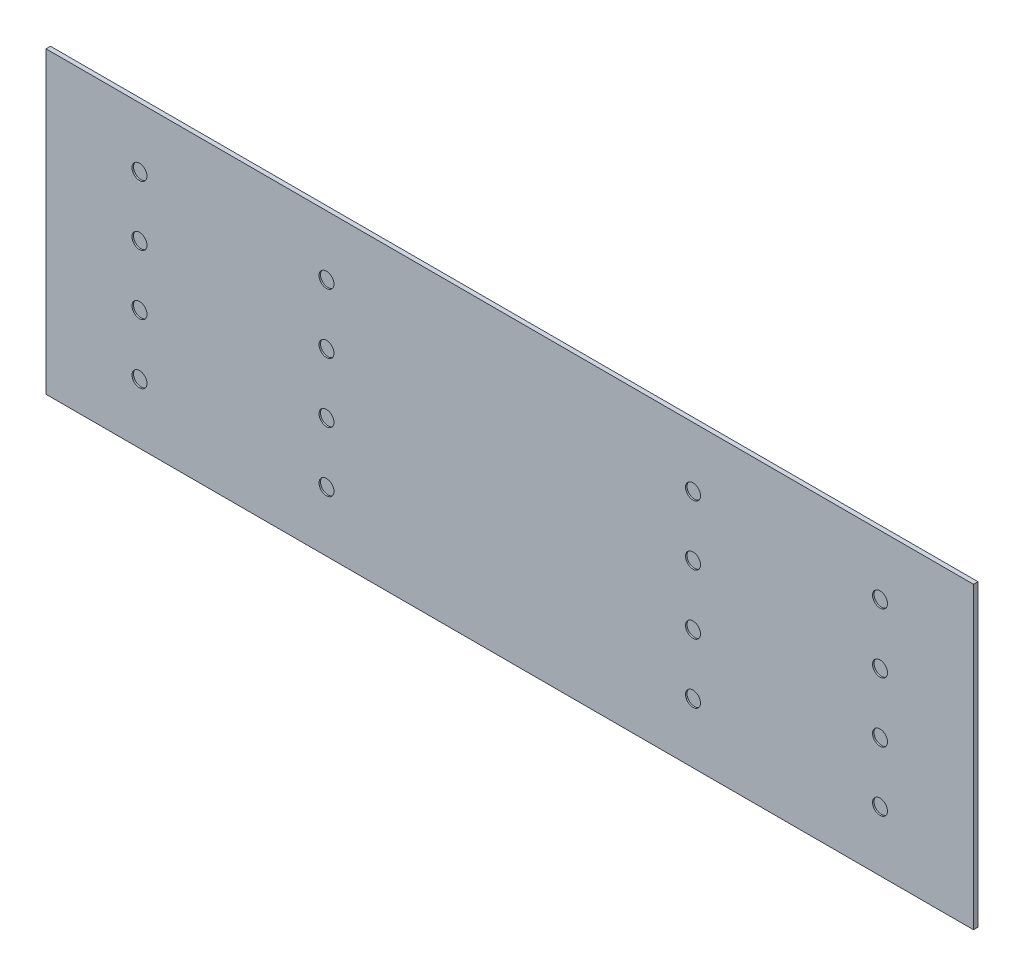
ISO-10303-21;
HEADER;
FILE_DESCRIPTION(('STEP AP214'),'2;1');
FILE_NAME('part.step','',(''),(''),'','','');
FILE_SCHEMA(('AUTOMOTIVE_DESIGN { 1 0 10303 214 1 1 1 1 }'));
ENDSEC;
DATA;
#1=APPLICATION_CONTEXT('core data for automotive mechanical design processes');
#2=APPLICATION_PROTOCOL_DEFINITION('international standard','automotive_design',2000,#1);
#3=PRODUCT_CONTEXT('',#1,'mechanical');
#4=PRODUCT('Part','Part','',(#3));
#5=PRODUCT_RELATED_PRODUCT_CATEGORY('part','',(#4));
#6=PRODUCT_DEFINITION_FORMATION('','',#4);
#7=PRODUCT_DEFINITION_CONTEXT('part definition',#1,'design');
#8=PRODUCT_DEFINITION('design','',#6,#7);
#9=PRODUCT_DEFINITION_SHAPE('','',#8);
#10=(LENGTH_UNIT() NAMED_UNIT(*) SI_UNIT(.MILLI.,.METRE.));
#11=(NAMED_UNIT(*) PLANE_ANGLE_UNIT() SI_UNIT($,.RADIAN.));
#12=(NAMED_UNIT(*) SI_UNIT($,.STERADIAN.) SOLID_ANGLE_UNIT());
#13=UNCERTAINTY_MEASURE_WITH_UNIT(LENGTH_MEASURE(1.E-05),#10,'distance_accuracy_value','');
#14=(GEOMETRIC_REPRESENTATION_CONTEXT(3) GLOBAL_UNCERTAINTY_ASSIGNED_CONTEXT((#13)) GLOBAL_UNIT_ASSIGNED_CONTEXT((#10,
#11,#12)) REPRESENTATION_CONTEXT('',''));
#15=CARTESIAN_POINT('',(0.,0.,0.));
#16=DIRECTION('',(0.,0.,1.));
#17=DIRECTION('',(1.,0.,0.));
#18=AXIS2_PLACEMENT_3D('',#15,#16,#17);
#19=CARTESIAN_POINT('',(31.,10.,0.3));
#20=DIRECTION('',(-1.,0.,0.));
#21=DIRECTION('',(0.,-1.,0.));
#22=AXIS2_PLACEMENT_3D('',#19,#20,#21);
#23=PLANE('',#22);
#24=DIRECTION('',(0.,1.,0.));
#25=VECTOR('',#24,1.);
#26=CARTESIAN_POINT('',(31.,10.,0.));
#27=LINE('',#26,#25);
#28=CARTESIAN_POINT('',(31.,-10.,0.));
#29=VERTEX_POINT('',#28);
#30=CARTESIAN_POINT('',(31.,10.,0.));
#31=VERTEX_POINT('',#30);
#32=EDGE_CURVE('E96',#29,#31,#27,.T.);
#33=ORIENTED_EDGE('',*,*,#32,.T.);
#34=DIRECTION('',(0.,0.,-1.));
#35=VECTOR('',#34,1.);
#36=CARTESIAN_POINT('',(31.,10.,0.3));
#37=LINE('',#36,#35);
#38=CARTESIAN_POINT('',(31.,10.,0.3));
#39=VERTEX_POINT('',#38);
#40=EDGE_CURVE('E11',#39,#31,#37,.T.);
#41=ORIENTED_EDGE('',*,*,#40,.F.);
#42=DIRECTION('',(0.,1.,0.));
#43=VECTOR('',#42,1.);
#44=CARTESIAN_POINT('',(31.,10.,0.3));
#45=LINE('',#44,#43);
#46=CARTESIAN_POINT('',(31.,-10.,0.3));
#47=VERTEX_POINT('',#46);
#48=EDGE_CURVE('E84',#47,#39,#45,.T.);
#49=ORIENTED_EDGE('',*,*,#48,.F.);
#50=DIRECTION('',(0.,0.,-1.));
#51=VECTOR('',#50,1.);
#52=CARTESIAN_POINT('',(31.,-10.,0.3));
#53=LINE('',#52,#51);
#54=EDGE_CURVE('E92',#47,#29,#53,.T.);
#55=ORIENTED_EDGE('',*,*,#54,.T.);
#56=EDGE_LOOP('',(#33,#41,#49,#55));
#57=FACE_BOUND('',#56,.T.);
#58=ADVANCED_FACE('F33',(#57),#23,.F.);
#59=CARTESIAN_POINT('',(-31.,10.,0.3));
#60=DIRECTION('',(0.,-1.,0.));
#61=DIRECTION('',(0.,0.,-1.));
#62=AXIS2_PLACEMENT_3D('',#59,#60,#61);
#63=PLANE('',#62);
#64=DIRECTION('',(-1.,0.,0.));
#65=VECTOR('',#64,1.);
#66=CARTESIAN_POINT('',(-31.,10.,0.));
#67=LINE('',#66,#65);
#68=CARTESIAN_POINT('',(-31.,10.,0.));
#69=VERTEX_POINT('',#68);
#70=EDGE_CURVE('E88',#31,#69,#67,.T.);
#71=ORIENTED_EDGE('',*,*,#70,.T.);
#72=DIRECTION('',(0.,0.,-1.));
#73=VECTOR('',#72,1.);
#74=CARTESIAN_POINT('',(-31.,10.,0.3));
#75=LINE('',#74,#73);
#76=CARTESIAN_POINT('',(-31.,10.,0.3));
#77=VERTEX_POINT('',#76);
#78=EDGE_CURVE('E41',#77,#69,#75,.T.);
#79=ORIENTED_EDGE('',*,*,#78,.F.);
#80=DIRECTION('',(-1.,0.,0.));
#81=VECTOR('',#80,1.);
#82=CARTESIAN_POINT('',(-31.,10.,0.3));
#83=LINE('',#82,#81);
#84=EDGE_CURVE('E79',#39,#77,#83,.T.);
#85=ORIENTED_EDGE('',*,*,#84,.F.);
#86=ORIENTED_EDGE('',*,*,#40,.T.);
#87=EDGE_LOOP('',(#71,#79,#85,#86));
#88=FACE_BOUND('',#87,.T.);
#89=ADVANCED_FACE('F87',(#88),#63,.F.);
#90=CARTESIAN_POINT('',(-31.,10.,0.3));
#91=DIRECTION('',(1.,0.,0.));
#92=DIRECTION('',(0.,1.,0.));
#93=AXIS2_PLACEMENT_3D('',#90,#91,#92);
#94=PLANE('',#93);
#95=DIRECTION('',(0.,-1.,0.));
#96=VECTOR('',#95,1.);
#97=CARTESIAN_POINT('',(-31.,10.,0.));
#98=LINE('',#97,#96);
#99=CARTESIAN_POINT('',(-31.,-10.,0.));
#100=VERTEX_POINT('',#99);
#101=EDGE_CURVE('E66',#69,#100,#98,.T.);
#102=ORIENTED_EDGE('',*,*,#101,.T.);
#103=DIRECTION('',(0.,0.,-1.));
#104=VECTOR('',#103,1.);
#105=CARTESIAN_POINT('',(-31.,-10.,0.3));
#106=LINE('',#105,#104);
#107=CARTESIAN_POINT('',(-31.,-10.,0.3));
#108=VERTEX_POINT('',#107);
#109=EDGE_CURVE('E89',#108,#100,#106,.T.);
#110=ORIENTED_EDGE('',*,*,#109,.F.);
#111=DIRECTION('',(0.,-1.,0.));
#112=VECTOR('',#111,1.);
#113=CARTESIAN_POINT('',(-31.,10.,0.3));
#114=LINE('',#113,#112);
#115=EDGE_CURVE('E82',#77,#108,#114,.T.);
#116=ORIENTED_EDGE('',*,*,#115,.F.);
#117=ORIENTED_EDGE('',*,*,#78,.T.);
#118=EDGE_LOOP('',(#102,#110,#116,#117));
#119=FACE_BOUND('',#118,.T.);
#120=ADVANCED_FACE('F90',(#119),#94,.F.);
#121=CARTESIAN_POINT('',(-31.,-10.,0.3));
#122=DIRECTION('',(0.,1.,0.));
#123=DIRECTION('',(0.,0.,1.));
#124=AXIS2_PLACEMENT_3D('',#121,#122,#123);
#125=PLANE('',#124);
#126=DIRECTION('',(1.,0.,0.));
#127=VECTOR('',#126,1.);
#128=CARTESIAN_POINT('',(-31.,-10.,0.));
#129=LINE('',#128,#127);
#130=EDGE_CURVE('E72',#100,#29,#129,.T.);
#131=ORIENTED_EDGE('',*,*,#130,.T.);
#132=ORIENTED_EDGE('',*,*,#54,.F.);
#133=DIRECTION('',(1.,0.,0.));
#134=VECTOR('',#133,1.);
#135=CARTESIAN_POINT('',(-31.,-10.,0.3));
#136=LINE('',#135,#134);
#137=EDGE_CURVE('E49',#108,#47,#136,.T.);
#138=ORIENTED_EDGE('',*,*,#137,.F.);
#139=ORIENTED_EDGE('',*,*,#109,.T.);
#140=EDGE_LOOP('',(#131,#132,#138,#139));
#141=FACE_BOUND('',#140,.T.);
#142=ADVANCED_FACE('F104',(#141),#125,.F.);
#143=CARTESIAN_POINT('',(0.,0.,0.3));
#144=DIRECTION('',(0.,0.,1.));
#145=DIRECTION('',(1.,0.,0.));
#146=AXIS2_PLACEMENT_3D('',#143,#144,#145);
#147=PLANE('',#146);
#148=CARTESIAN_POINT('',(-12.25,2.,0.3));
#149=DIRECTION('',(0.,0.,1.));
#150=DIRECTION('',(-1.,0.,0.));
#151=AXIS2_PLACEMENT_3D('',#148,#149,#150);
#152=CIRCLE('',#151,0.499999999999999);
#153=CARTESIAN_POINT('',(-12.75,2.,0.3));
#154=VERTEX_POINT('',#153);
#155=EDGE_CURVE('E140',#154,#154,#152,.T.);
#156=ORIENTED_EDGE('',*,*,#155,.F.);
#157=EDGE_LOOP('',(#156));
#158=FACE_BOUND('',#157,.T.);
#159=CARTESIAN_POINT('',(-24.75,2.,0.3));
#160=DIRECTION('',(0.,0.,1.));
#161=DIRECTION('',(1.,0.,0.));
#162=AXIS2_PLACEMENT_3D('',#159,#160,#161);
#163=CIRCLE('',#162,0.499999999999999);
#164=CARTESIAN_POINT('',(-24.25,2.,0.3));
#165=VERTEX_POINT('',#164);
#166=EDGE_CURVE('E147',#165,#165,#163,.T.);
#167=ORIENTED_EDGE('',*,*,#166,.F.);
#168=EDGE_LOOP('',(#167));
#169=FACE_BOUND('',#168,.T.);
#170=CARTESIAN_POINT('',(-24.75,-2.,0.3));
#171=DIRECTION('',(0.,0.,1.));
#172=DIRECTION('',(-1.,0.,0.));
#173=AXIS2_PLACEMENT_3D('',#170,#171,#172);
#174=CIRCLE('',#173,0.499999999999999);
#175=CARTESIAN_POINT('',(-25.25,-2.,0.3));
#176=VERTEX_POINT('',#175);
#177=EDGE_CURVE('E153',#176,#176,#174,.T.);
#178=ORIENTED_EDGE('',*,*,#177,.F.);
#179=EDGE_LOOP('',(#178));
#180=FACE_BOUND('',#179,.T.);
#181=CARTESIAN_POINT('',(-24.75,-6.,0.3));
#182=DIRECTION('',(0.,0.,1.));
#183=DIRECTION('',(1.,0.,0.));
#184=AXIS2_PLACEMENT_3D('',#181,#182,#183);
#185=CIRCLE('',#184,0.500000000000003);
#186=CARTESIAN_POINT('',(-24.25,-6.,0.3));
#187=VERTEX_POINT('',#186);
#188=EDGE_CURVE('E159',#187,#187,#185,.T.);
#189=ORIENTED_EDGE('',*,*,#188,.F.);
#190=EDGE_LOOP('',(#189));
#191=FACE_BOUND('',#190,.T.);
#192=CARTESIAN_POINT('',(12.25,1.99999999999999,0.3));
#193=DIRECTION('',(0.,0.,1.));
#194=DIRECTION('',(1.,0.,0.));
#195=AXIS2_PLACEMENT_3D('',#192,#193,#194);
#196=CIRCLE('',#195,0.500000000000002);
#197=CARTESIAN_POINT('',(12.75,1.99999999999999,0.3));
#198=VERTEX_POINT('',#197);
#199=EDGE_CURVE('E123',#198,#198,#196,.T.);
#200=ORIENTED_EDGE('',*,*,#199,.F.);
#201=EDGE_LOOP('',(#200));
#202=FACE_BOUND('',#201,.T.);
#203=CARTESIAN_POINT('',(-24.75,6.,0.3));
#204=DIRECTION('',(0.,0.,1.));
#205=DIRECTION('',(1.,0.,0.));
#206=AXIS2_PLACEMENT_3D('',#203,#204,#205);
#207=CIRCLE('',#206,0.500000000000003);
#208=CARTESIAN_POINT('',(-24.25,6.,0.3));
#209=VERTEX_POINT('',#208);
#210=EDGE_CURVE('E116',#209,#209,#207,.T.);
#211=ORIENTED_EDGE('',*,*,#210,.F.);
#212=EDGE_LOOP('',(#211));
#213=FACE_BOUND('',#212,.T.);
#214=CARTESIAN_POINT('',(24.75,-2.00000000000002,0.3));
#215=DIRECTION('',(0.,0.,1.));
#216=DIRECTION('',(1.,0.,0.));
#217=AXIS2_PLACEMENT_3D('',#214,#215,#216);
#218=CIRCLE('',#217,0.499999999999999);
#219=CARTESIAN_POINT('',(25.25,-2.00000000000002,0.3));
#220=VERTEX_POINT('',#219);
#221=EDGE_CURVE('E135',#220,#220,#218,.T.);
#222=ORIENTED_EDGE('',*,*,#221,.F.);
#223=EDGE_LOOP('',(#222));
#224=FACE_BOUND('',#223,.T.);
#225=CARTESIAN_POINT('',(-12.25,6.,0.3));
#226=DIRECTION('',(0.,0.,1.));
#227=DIRECTION('',(1.,0.,0.));
#228=AXIS2_PLACEMENT_3D('',#225,#226,#227);
#229=CIRCLE('',#228,0.500000000000001);
#230=CARTESIAN_POINT('',(-11.75,6.,0.3));
#231=VERTEX_POINT('',#230);
#232=EDGE_CURVE('E128',#231,#231,#229,.T.);
#233=ORIENTED_EDGE('',*,*,#232,.F.);
#234=EDGE_LOOP('',(#233));
#235=FACE_BOUND('',#234,.T.);
#236=CARTESIAN_POINT('',(24.75,5.99999999999998,0.3));
#237=DIRECTION('',(0.,0.,1.));
#238=DIRECTION('',(-1.,0.,0.));
#239=AXIS2_PLACEMENT_3D('',#236,#237,#238);
#240=CIRCLE('',#239,0.500000000000003);
#241=CARTESIAN_POINT('',(24.25,5.99999999999998,0.3));
#242=VERTEX_POINT('',#241);
#243=EDGE_CURVE('E188',#242,#242,#240,.T.);
#244=ORIENTED_EDGE('',*,*,#243,.F.);
#245=EDGE_LOOP('',(#244));
#246=FACE_BOUND('',#245,.T.);
#247=CARTESIAN_POINT('',(12.25,5.99999999999999,0.3));
#248=DIRECTION('',(0.,0.,1.));
#249=DIRECTION('',(-1.,0.,0.));
#250=AXIS2_PLACEMENT_3D('',#247,#248,#249);
#251=CIRCLE('',#250,0.500000000000001);
#252=CARTESIAN_POINT('',(11.75,5.99999999999999,0.3));
#253=VERTEX_POINT('',#252);
#254=EDGE_CURVE('E194',#253,#253,#251,.T.);
#255=ORIENTED_EDGE('',*,*,#254,.F.);
#256=EDGE_LOOP('',(#255));
#257=FACE_BOUND('',#256,.T.);
#258=CARTESIAN_POINT('',(12.25,-6.00000000000001,0.3));
#259=DIRECTION('',(0.,0.,1.));
#260=DIRECTION('',(-1.,0.,0.));
#261=AXIS2_PLACEMENT_3D('',#258,#259,#260);
#262=CIRCLE('',#261,0.499999999999999);
#263=CARTESIAN_POINT('',(11.75,-6.00000000000001,0.3));
#264=VERTEX_POINT('',#263);
#265=EDGE_CURVE('E200',#264,#264,#262,.T.);
#266=ORIENTED_EDGE('',*,*,#265,.F.);
#267=EDGE_LOOP('',(#266));
#268=FACE_BOUND('',#267,.T.);
#269=CARTESIAN_POINT('',(24.75,-6.00000000000001,0.3));
#270=DIRECTION('',(0.,0.,1.));
#271=DIRECTION('',(-1.,0.,0.));
#272=AXIS2_PLACEMENT_3D('',#269,#270,#271);
#273=CIRCLE('',#272,0.500000000000003);
#274=CARTESIAN_POINT('',(24.25,-6.00000000000001,0.3));
#275=VERTEX_POINT('',#274);
#276=EDGE_CURVE('E164',#275,#275,#273,.T.);
#277=ORIENTED_EDGE('',*,*,#276,.F.);
#278=EDGE_LOOP('',(#277));
#279=FACE_BOUND('',#278,.T.);
#280=CARTESIAN_POINT('',(24.75,1.99999999999998,0.3));
#281=DIRECTION('',(0.,0.,1.));
#282=DIRECTION('',(-1.,0.,0.));
#283=AXIS2_PLACEMENT_3D('',#280,#281,#282);
#284=CIRCLE('',#283,0.499999999999999);
#285=CARTESIAN_POINT('',(24.25,1.99999999999998,0.3));
#286=VERTEX_POINT('',#285);
#287=EDGE_CURVE('E171',#286,#286,#284,.T.);
#288=ORIENTED_EDGE('',*,*,#287,.F.);
#289=EDGE_LOOP('',(#288));
#290=FACE_BOUND('',#289,.T.);
#291=CARTESIAN_POINT('',(-12.25,-6.,0.3));
#292=DIRECTION('',(0.,0.,1.));
#293=DIRECTION('',(1.,0.,0.));
#294=AXIS2_PLACEMENT_3D('',#291,#292,#293);
#295=CIRCLE('',#294,0.499999999999999);
#296=CARTESIAN_POINT('',(-11.75,-6.,0.3));
#297=VERTEX_POINT('',#296);
#298=EDGE_CURVE('E177',#297,#297,#295,.T.);
#299=ORIENTED_EDGE('',*,*,#298,.F.);
#300=EDGE_LOOP('',(#299));
#301=FACE_BOUND('',#300,.T.);
#302=CARTESIAN_POINT('',(-12.25,-2.,0.3));
#303=DIRECTION('',(0.,0.,1.));
#304=DIRECTION('',(1.,0.,0.));
#305=AXIS2_PLACEMENT_3D('',#302,#303,#304);
#306=CIRCLE('',#305,0.499999999999999);
#307=CARTESIAN_POINT('',(-11.75,-2.,0.3));
#308=VERTEX_POINT('',#307);
#309=EDGE_CURVE('E183',#308,#308,#306,.T.);
#310=ORIENTED_EDGE('',*,*,#309,.F.);
#311=EDGE_LOOP('',(#310));
#312=FACE_BOUND('',#311,.T.);
#313=CARTESIAN_POINT('',(12.25,-2.00000000000001,0.3));
#314=DIRECTION('',(0.,0.,1.));
#315=DIRECTION('',(-1.,0.,0.));
#316=AXIS2_PLACEMENT_3D('',#313,#314,#315);
#317=CIRCLE('',#316,0.499999999999999);
#318=CARTESIAN_POINT('',(11.75,-2.00000000000001,0.3));
#319=VERTEX_POINT('',#318);
#320=EDGE_CURVE('E110',#319,#319,#317,.T.);
#321=ORIENTED_EDGE('',*,*,#320,.F.);
#322=EDGE_LOOP('',(#321));
#323=FACE_BOUND('',#322,.T.);
#324=ORIENTED_EDGE('',*,*,#48,.T.);
#325=ORIENTED_EDGE('',*,*,#84,.T.);
#326=ORIENTED_EDGE('',*,*,#115,.T.);
#327=ORIENTED_EDGE('',*,*,#137,.T.);
#328=EDGE_LOOP('',(#324,#325,#326,#327));
#329=FACE_BOUND('',#328,.T.);
#330=ADVANCED_FACE('F80',(#158,#169,#180,#191,#202,#213,#224,#235,#246,#257,#268,#279,#290,#301,
#312,#323,#329),#147,.T.);
#331=CARTESIAN_POINT('',(0.,0.,0.));
#332=DIRECTION('',(0.,0.,1.));
#333=DIRECTION('',(1.,0.,0.));
#334=AXIS2_PLACEMENT_3D('',#331,#332,#333);
#335=PLANE('',#334);
#336=ORIENTED_EDGE('',*,*,#32,.F.);
#337=ORIENTED_EDGE('',*,*,#130,.F.);
#338=ORIENTED_EDGE('',*,*,#101,.F.);
#339=ORIENTED_EDGE('',*,*,#70,.F.);
#340=EDGE_LOOP('',(#336,#337,#338,#339));
#341=FACE_BOUND('',#340,.T.);
#342=ADVANCED_FACE('F107',(#341),#335,.F.);
#343=CARTESIAN_POINT('',(12.25,-2.00000000000001,0.2));
#344=DIRECTION('',(0.,0.,1.));
#345=DIRECTION('',(1.,0.,0.));
#346=AXIS2_PLACEMENT_3D('',#343,#344,#345);
#347=CYLINDRICAL_SURFACE('',#346,0.499999999999999);
#348=CARTESIAN_POINT('',(12.25,-2.00000000000001,0.2));
#349=DIRECTION('',(0.,0.,1.));
#350=DIRECTION('',(-1.,0.,0.));
#351=AXIS2_PLACEMENT_3D('',#348,#349,#350);
#352=CIRCLE('',#351,0.499999999999999);
#353=CARTESIAN_POINT('',(11.75,-2.00000000000001,0.2));
#354=VERTEX_POINT('',#353);
#355=EDGE_CURVE('E99',#354,#354,#352,.T.);
#356=ORIENTED_EDGE('',*,*,#355,.F.);
#357=EDGE_LOOP('',(#356));
#358=FACE_BOUND('',#357,.T.);
#359=ORIENTED_EDGE('',*,*,#320,.T.);
#360=EDGE_LOOP('',(#359));
#361=FACE_BOUND('',#360,.T.);
#362=ADVANCED_FACE('F229',(#358,#361),#347,.F.);
#363=CARTESIAN_POINT('',(12.25,-2.00000000000001,0.2));
#364=DIRECTION('',(0.,0.,-1.));
#365=DIRECTION('',(-1.,0.,0.));
#366=AXIS2_PLACEMENT_3D('',#363,#364,#365);
#367=PLANE('',#366);
#368=ORIENTED_EDGE('',*,*,#355,.T.);
#369=EDGE_LOOP('',(#368));
#370=FACE_BOUND('',#369,.T.);
#371=ADVANCED_FACE('F231',(#370),#367,.F.);
#372=CARTESIAN_POINT('',(-12.25,-2.,0.2));
#373=DIRECTION('',(0.,0.,1.));
#374=DIRECTION('',(1.,0.,0.));
#375=AXIS2_PLACEMENT_3D('',#372,#373,#374);
#376=CYLINDRICAL_SURFACE('',#375,0.499999999999999);
#377=CARTESIAN_POINT('',(-12.25,-2.,0.2));
#378=DIRECTION('',(0.,0.,1.));
#379=DIRECTION('',(1.,0.,0.));
#380=AXIS2_PLACEMENT_3D('',#377,#378,#379);
#381=CIRCLE('',#380,0.499999999999999);
#382=CARTESIAN_POINT('',(-11.75,-2.,0.2));
#383=VERTEX_POINT('',#382);
#384=EDGE_CURVE('E144',#383,#383,#381,.T.);
#385=ORIENTED_EDGE('',*,*,#384,.F.);
#386=EDGE_LOOP('',(#385));
#387=FACE_BOUND('',#386,.T.);
#388=ORIENTED_EDGE('',*,*,#309,.T.);
#389=EDGE_LOOP('',(#388));
#390=FACE_BOUND('',#389,.T.);
#391=ADVANCED_FACE('F238',(#387,#390),#376,.F.);
#392=CARTESIAN_POINT('',(-12.25,-2.,0.2));
#393=DIRECTION('',(0.,0.,1.));
#394=DIRECTION('',(1.,0.,0.));
#395=AXIS2_PLACEMENT_3D('',#392,#393,#394);
#396=PLANE('',#395);
#397=ORIENTED_EDGE('',*,*,#384,.T.);
#398=EDGE_LOOP('',(#397));
#399=FACE_BOUND('',#398,.T.);
#400=ADVANCED_FACE('F286',(#399),#396,.T.);
#401=CARTESIAN_POINT('',(-12.25,-6.,0.2));
#402=DIRECTION('',(0.,0.,1.));
#403=DIRECTION('',(1.,0.,0.));
#404=AXIS2_PLACEMENT_3D('',#401,#402,#403);
#405=CYLINDRICAL_SURFACE('',#404,0.499999999999999);
#406=CARTESIAN_POINT('',(-12.25,-6.,0.2));
#407=DIRECTION('',(0.,0.,1.));
#408=DIRECTION('',(1.,0.,0.));
#409=AXIS2_PLACEMENT_3D('',#406,#407,#408);
#410=CIRCLE('',#409,0.499999999999999);
#411=CARTESIAN_POINT('',(-11.75,-6.,0.2));
#412=VERTEX_POINT('',#411);
#413=EDGE_CURVE('E180',#412,#412,#410,.T.);
#414=ORIENTED_EDGE('',*,*,#413,.F.);
#415=EDGE_LOOP('',(#414));
#416=FACE_BOUND('',#415,.T.);
#417=ORIENTED_EDGE('',*,*,#298,.T.);
#418=EDGE_LOOP('',(#417));
#419=FACE_BOUND('',#418,.T.);
#420=ADVANCED_FACE('F295',(#416,#419),#405,.F.);
#421=CARTESIAN_POINT('',(-12.25,-6.,0.2));
#422=DIRECTION('',(0.,0.,1.));
#423=DIRECTION('',(1.,0.,0.));
#424=AXIS2_PLACEMENT_3D('',#421,#422,#423);
#425=PLANE('',#424);
#426=ORIENTED_EDGE('',*,*,#413,.T.);
#427=EDGE_LOOP('',(#426));
#428=FACE_BOUND('',#427,.T.);
#429=ADVANCED_FACE('F304',(#428),#425,.T.);
#430=CARTESIAN_POINT('',(24.75,1.99999999999998,0.2));
#431=DIRECTION('',(0.,0.,1.));
#432=DIRECTION('',(1.,0.,0.));
#433=AXIS2_PLACEMENT_3D('',#430,#431,#432);
#434=CYLINDRICAL_SURFACE('',#433,0.499999999999999);
#435=CARTESIAN_POINT('',(24.75,1.99999999999998,0.2));
#436=DIRECTION('',(0.,0.,1.));
#437=DIRECTION('',(-1.,0.,0.));
#438=AXIS2_PLACEMENT_3D('',#435,#436,#437);
#439=CIRCLE('',#438,0.499999999999999);
#440=CARTESIAN_POINT('',(24.25,1.99999999999998,0.2));
#441=VERTEX_POINT('',#440);
#442=EDGE_CURVE('E174',#441,#441,#439,.T.);
#443=ORIENTED_EDGE('',*,*,#442,.F.);
#444=EDGE_LOOP('',(#443));
#445=FACE_BOUND('',#444,.T.);
#446=ORIENTED_EDGE('',*,*,#287,.T.);
#447=EDGE_LOOP('',(#446));
#448=FACE_BOUND('',#447,.T.);
#449=ADVANCED_FACE('F313',(#445,#448),#434,.F.);
#450=CARTESIAN_POINT('',(24.75,1.99999999999998,0.2));
#451=DIRECTION('',(0.,0.,-1.));
#452=DIRECTION('',(-1.,0.,0.));
#453=AXIS2_PLACEMENT_3D('',#450,#451,#452);
#454=PLANE('',#453);
#455=ORIENTED_EDGE('',*,*,#442,.T.);
#456=EDGE_LOOP('',(#455));
#457=FACE_BOUND('',#456,.T.);
#458=ADVANCED_FACE('F322',(#457),#454,.F.);
#459=CARTESIAN_POINT('',(24.75,-6.00000000000001,0.2));
#460=DIRECTION('',(0.,0.,1.));
#461=DIRECTION('',(1.,0.,0.));
#462=AXIS2_PLACEMENT_3D('',#459,#460,#461);
#463=CYLINDRICAL_SURFACE('',#462,0.500000000000003);
#464=CARTESIAN_POINT('',(24.75,-6.00000000000001,0.2));
#465=DIRECTION('',(0.,0.,1.));
#466=DIRECTION('',(-1.,0.,0.));
#467=AXIS2_PLACEMENT_3D('',#464,#465,#466);
#468=CIRCLE('',#467,0.500000000000003);
#469=CARTESIAN_POINT('',(24.25,-6.00000000000001,0.2));
#470=VERTEX_POINT('',#469);
#471=EDGE_CURVE('E167',#470,#470,#468,.T.);
#472=ORIENTED_EDGE('',*,*,#471,.F.);
#473=EDGE_LOOP('',(#472));
#474=FACE_BOUND('',#473,.T.);
#475=ORIENTED_EDGE('',*,*,#276,.T.);
#476=EDGE_LOOP('',(#475));
#477=FACE_BOUND('',#476,.T.);
#478=ADVANCED_FACE('F331',(#474,#477),#463,.F.);
#479=CARTESIAN_POINT('',(24.75,-6.00000000000001,0.2));
#480=DIRECTION('',(0.,0.,-1.));
#481=DIRECTION('',(-1.,0.,0.));
#482=AXIS2_PLACEMENT_3D('',#479,#480,#481);
#483=PLANE('',#482);
#484=ORIENTED_EDGE('',*,*,#471,.T.);
#485=EDGE_LOOP('',(#484));
#486=FACE_BOUND('',#485,.T.);
#487=ADVANCED_FACE('F211',(#486),#483,.F.);
#488=CARTESIAN_POINT('',(12.25,-6.00000000000001,0.2));
#489=DIRECTION('',(0.,0.,1.));
#490=DIRECTION('',(1.,0.,0.));
#491=AXIS2_PLACEMENT_3D('',#488,#489,#490);
#492=CYLINDRICAL_SURFACE('',#491,0.499999999999999);
#493=CARTESIAN_POINT('',(12.25,-6.00000000000001,0.2));
#494=DIRECTION('',(0.,0.,1.));
#495=DIRECTION('',(-1.,0.,0.));
#496=AXIS2_PLACEMENT_3D('',#493,#494,#495);
#497=CIRCLE('',#496,0.499999999999999);
#498=CARTESIAN_POINT('',(11.75,-6.00000000000001,0.2));
#499=VERTEX_POINT('',#498);
#500=EDGE_CURVE('E168',#499,#499,#497,.T.);
#501=ORIENTED_EDGE('',*,*,#500,.F.);
#502=EDGE_LOOP('',(#501));
#503=FACE_BOUND('',#502,.T.);
#504=ORIENTED_EDGE('',*,*,#265,.T.);
#505=EDGE_LOOP('',(#504));
#506=FACE_BOUND('',#505,.T.);
#507=ADVANCED_FACE('F208',(#503,#506),#492,.F.);
#508=CARTESIAN_POINT('',(12.25,-6.00000000000001,0.2));
#509=DIRECTION('',(0.,0.,-1.));
#510=DIRECTION('',(-1.,0.,0.));
#511=AXIS2_PLACEMENT_3D('',#508,#509,#510);
#512=PLANE('',#511);
#513=ORIENTED_EDGE('',*,*,#500,.T.);
#514=EDGE_LOOP('',(#513));
#515=FACE_BOUND('',#514,.T.);
#516=ADVANCED_FACE('F206',(#515),#512,.F.);
#517=CARTESIAN_POINT('',(12.25,5.99999999999999,0.2));
#518=DIRECTION('',(0.,0.,1.));
#519=DIRECTION('',(1.,0.,0.));
#520=AXIS2_PLACEMENT_3D('',#517,#518,#519);
#521=CYLINDRICAL_SURFACE('',#520,0.500000000000001);
#522=CARTESIAN_POINT('',(12.25,5.99999999999999,0.2));
#523=DIRECTION('',(0.,0.,1.));
#524=DIRECTION('',(-1.,0.,0.));
#525=AXIS2_PLACEMENT_3D('',#522,#523,#524);
#526=CIRCLE('',#525,0.500000000000001);
#527=CARTESIAN_POINT('',(11.75,5.99999999999999,0.2));
#528=VERTEX_POINT('',#527);
#529=EDGE_CURVE('E197',#528,#528,#526,.T.);
#530=ORIENTED_EDGE('',*,*,#529,.F.);
#531=EDGE_LOOP('',(#530));
#532=FACE_BOUND('',#531,.T.);
#533=ORIENTED_EDGE('',*,*,#254,.T.);
#534=EDGE_LOOP('',(#533));
#535=FACE_BOUND('',#534,.T.);
#536=ADVANCED_FACE('F361',(#532,#535),#521,.F.);
#537=CARTESIAN_POINT('',(12.25,5.99999999999999,0.2));
#538=DIRECTION('',(0.,0.,-1.));
#539=DIRECTION('',(-1.,0.,0.));
#540=AXIS2_PLACEMENT_3D('',#537,#538,#539);
#541=PLANE('',#540);
#542=ORIENTED_EDGE('',*,*,#529,.T.);
#543=EDGE_LOOP('',(#542));
#544=FACE_BOUND('',#543,.T.);
#545=ADVANCED_FACE('F369',(#544),#541,.F.);
#546=CARTESIAN_POINT('',(24.75,5.99999999999998,0.2));
#547=DIRECTION('',(0.,0.,1.));
#548=DIRECTION('',(1.,0.,0.));
#549=AXIS2_PLACEMENT_3D('',#546,#547,#548);
#550=CYLINDRICAL_SURFACE('',#549,0.500000000000003);
#551=CARTESIAN_POINT('',(24.75,5.99999999999998,0.2));
#552=DIRECTION('',(0.,0.,1.));
#553=DIRECTION('',(-1.,0.,0.));
#554=AXIS2_PLACEMENT_3D('',#551,#552,#553);
#555=CIRCLE('',#554,0.500000000000003);
#556=CARTESIAN_POINT('',(24.25,5.99999999999998,0.2));
#557=VERTEX_POINT('',#556);
#558=EDGE_CURVE('E191',#557,#557,#555,.T.);
#559=ORIENTED_EDGE('',*,*,#558,.F.);
#560=EDGE_LOOP('',(#559));
#561=FACE_BOUND('',#560,.T.);
#562=ORIENTED_EDGE('',*,*,#243,.T.);
#563=EDGE_LOOP('',(#562));
#564=FACE_BOUND('',#563,.T.);
#565=ADVANCED_FACE('F378',(#561,#564),#550,.F.);
#566=CARTESIAN_POINT('',(24.75,5.99999999999998,0.2));
#567=DIRECTION('',(0.,0.,-1.));
#568=DIRECTION('',(-1.,0.,0.));
#569=AXIS2_PLACEMENT_3D('',#566,#567,#568);
#570=PLANE('',#569);
#571=ORIENTED_EDGE('',*,*,#558,.T.);
#572=EDGE_LOOP('',(#571));
#573=FACE_BOUND('',#572,.T.);
#574=ADVANCED_FACE('F387',(#573),#570,.F.);
#575=CARTESIAN_POINT('',(-12.25,6.,0.2));
#576=DIRECTION('',(0.,0.,1.));
#577=DIRECTION('',(1.,0.,0.));
#578=AXIS2_PLACEMENT_3D('',#575,#576,#577);
#579=CYLINDRICAL_SURFACE('',#578,0.500000000000001);
#580=CARTESIAN_POINT('',(-12.25,6.,0.2));
#581=DIRECTION('',(0.,0.,1.));
#582=DIRECTION('',(1.,0.,0.));
#583=AXIS2_PLACEMENT_3D('',#580,#581,#582);
#584=CIRCLE('',#583,0.500000000000001);
#585=CARTESIAN_POINT('',(-11.75,6.,0.2));
#586=VERTEX_POINT('',#585);
#587=EDGE_CURVE('E131',#586,#586,#584,.T.);
#588=ORIENTED_EDGE('',*,*,#587,.F.);
#589=EDGE_LOOP('',(#588));
#590=FACE_BOUND('',#589,.T.);
#591=ORIENTED_EDGE('',*,*,#232,.T.);
#592=EDGE_LOOP('',(#591));
#593=FACE_BOUND('',#592,.T.);
#594=ADVANCED_FACE('F396',(#590,#593),#579,.F.);
#595=CARTESIAN_POINT('',(-12.25,6.,0.2));
#596=DIRECTION('',(0.,0.,1.));
#597=DIRECTION('',(1.,0.,0.));
#598=AXIS2_PLACEMENT_3D('',#595,#596,#597);
#599=PLANE('',#598);
#600=ORIENTED_EDGE('',*,*,#587,.T.);
#601=EDGE_LOOP('',(#600));
#602=FACE_BOUND('',#601,.T.);
#603=ADVANCED_FACE('F405',(#602),#599,.T.);
#604=CARTESIAN_POINT('',(24.75,-2.00000000000002,0.2));
#605=DIRECTION('',(0.,0.,1.));
#606=DIRECTION('',(1.,0.,0.));
#607=AXIS2_PLACEMENT_3D('',#604,#605,#606);
#608=CYLINDRICAL_SURFACE('',#607,0.499999999999999);
#609=CARTESIAN_POINT('',(24.75,-2.00000000000002,0.2));
#610=DIRECTION('',(0.,0.,1.));
#611=DIRECTION('',(1.,0.,0.));
#612=AXIS2_PLACEMENT_3D('',#609,#610,#611);
#613=CIRCLE('',#612,0.499999999999999);
#614=CARTESIAN_POINT('',(25.25,-2.00000000000002,0.2));
#615=VERTEX_POINT('',#614);
#616=EDGE_CURVE('E120',#615,#615,#613,.T.);
#617=ORIENTED_EDGE('',*,*,#616,.F.);
#618=EDGE_LOOP('',(#617));
#619=FACE_BOUND('',#618,.T.);
#620=ORIENTED_EDGE('',*,*,#221,.T.);
#621=EDGE_LOOP('',(#620));
#622=FACE_BOUND('',#621,.T.);
#623=ADVANCED_FACE('F414',(#619,#622),#608,.F.);
#624=CARTESIAN_POINT('',(24.75,-2.00000000000002,0.2));
#625=DIRECTION('',(0.,0.,1.));
#626=DIRECTION('',(1.,0.,0.));
#627=AXIS2_PLACEMENT_3D('',#624,#625,#626);
#628=PLANE('',#627);
#629=ORIENTED_EDGE('',*,*,#616,.T.);
#630=EDGE_LOOP('',(#629));
#631=FACE_BOUND('',#630,.T.);
#632=ADVANCED_FACE('F423',(#631),#628,.T.);
#633=CARTESIAN_POINT('',(-24.75,6.,0.2));
#634=DIRECTION('',(0.,0.,1.));
#635=DIRECTION('',(1.,0.,0.));
#636=AXIS2_PLACEMENT_3D('',#633,#634,#635);
#637=CYLINDRICAL_SURFACE('',#636,0.500000000000003);
#638=CARTESIAN_POINT('',(-24.75,6.,0.2));
#639=DIRECTION('',(0.,0.,1.));
#640=DIRECTION('',(1.,0.,0.));
#641=AXIS2_PLACEMENT_3D('',#638,#639,#640);
#642=CIRCLE('',#641,0.500000000000003);
#643=CARTESIAN_POINT('',(-24.25,6.,0.2));
#644=VERTEX_POINT('',#643);
#645=EDGE_CURVE('E119',#644,#644,#642,.T.);
#646=ORIENTED_EDGE('',*,*,#645,.F.);
#647=EDGE_LOOP('',(#646));
#648=FACE_BOUND('',#647,.T.);
#649=ORIENTED_EDGE('',*,*,#210,.T.);
#650=EDGE_LOOP('',(#649));
#651=FACE_BOUND('',#650,.T.);
#652=ADVANCED_FACE('F432',(#648,#651),#637,.F.);
#653=CARTESIAN_POINT('',(-24.75,6.,0.2));
#654=DIRECTION('',(0.,0.,1.));
#655=DIRECTION('',(1.,0.,0.));
#656=AXIS2_PLACEMENT_3D('',#653,#654,#655);
#657=PLANE('',#656);
#658=ORIENTED_EDGE('',*,*,#645,.T.);
#659=EDGE_LOOP('',(#658));
#660=FACE_BOUND('',#659,.T.);
#661=ADVANCED_FACE('F441',(#660),#657,.T.);
#662=CARTESIAN_POINT('',(12.25,1.99999999999999,0.2));
#663=DIRECTION('',(0.,0.,1.));
#664=DIRECTION('',(1.,0.,0.));
#665=AXIS2_PLACEMENT_3D('',#662,#663,#664);
#666=CYLINDRICAL_SURFACE('',#665,0.500000000000002);
#667=CARTESIAN_POINT('',(12.25,1.99999999999999,0.2));
#668=DIRECTION('',(0.,0.,1.));
#669=DIRECTION('',(1.,0.,0.));
#670=AXIS2_PLACEMENT_3D('',#667,#668,#669);
#671=CIRCLE('',#670,0.500000000000002);
#672=CARTESIAN_POINT('',(12.75,1.99999999999999,0.2));
#673=VERTEX_POINT('',#672);
#674=EDGE_CURVE('E113',#673,#673,#671,.T.);
#675=ORIENTED_EDGE('',*,*,#674,.F.);
#676=EDGE_LOOP('',(#675));
#677=FACE_BOUND('',#676,.T.);
#678=ORIENTED_EDGE('',*,*,#199,.T.);
#679=EDGE_LOOP('',(#678));
#680=FACE_BOUND('',#679,.T.);
#681=ADVANCED_FACE('F450',(#677,#680),#666,.F.);
#682=CARTESIAN_POINT('',(12.25,1.99999999999999,0.2));
#683=DIRECTION('',(0.,0.,1.));
#684=DIRECTION('',(1.,0.,0.));
#685=AXIS2_PLACEMENT_3D('',#682,#683,#684);
#686=PLANE('',#685);
#687=ORIENTED_EDGE('',*,*,#674,.T.);
#688=EDGE_LOOP('',(#687));
#689=FACE_BOUND('',#688,.T.);
#690=ADVANCED_FACE('F459',(#689),#686,.T.);
#691=CARTESIAN_POINT('',(-24.75,-6.,0.2));
#692=DIRECTION('',(0.,0.,1.));
#693=DIRECTION('',(1.,0.,0.));
#694=AXIS2_PLACEMENT_3D('',#691,#692,#693);
#695=CYLINDRICAL_SURFACE('',#694,0.500000000000003);
#696=CARTESIAN_POINT('',(-24.75,-6.,0.2));
#697=DIRECTION('',(0.,0.,1.));
#698=DIRECTION('',(1.,0.,0.));
#699=AXIS2_PLACEMENT_3D('',#696,#697,#698);
#700=CIRCLE('',#699,0.500000000000003);
#701=CARTESIAN_POINT('',(-24.25,-6.,0.2));
#702=VERTEX_POINT('',#701);
#703=EDGE_CURVE('E132',#702,#702,#700,.T.);
#704=ORIENTED_EDGE('',*,*,#703,.F.);
#705=EDGE_LOOP('',(#704));
#706=FACE_BOUND('',#705,.T.);
#707=ORIENTED_EDGE('',*,*,#188,.T.);
#708=EDGE_LOOP('',(#707));
#709=FACE_BOUND('',#708,.T.);
#710=ADVANCED_FACE('F468',(#706,#709),#695,.F.);
#711=CARTESIAN_POINT('',(-24.75,-6.,0.2));
#712=DIRECTION('',(0.,0.,1.));
#713=DIRECTION('',(1.,0.,0.));
#714=AXIS2_PLACEMENT_3D('',#711,#712,#713);
#715=PLANE('',#714);
#716=ORIENTED_EDGE('',*,*,#703,.T.);
#717=EDGE_LOOP('',(#716));
#718=FACE_BOUND('',#717,.T.);
#719=ADVANCED_FACE('F477',(#718),#715,.T.);
#720=CARTESIAN_POINT('',(-24.75,-2.,0.2));
#721=DIRECTION('',(0.,0.,1.));
#722=DIRECTION('',(1.,0.,0.));
#723=AXIS2_PLACEMENT_3D('',#720,#721,#722);
#724=CYLINDRICAL_SURFACE('',#723,0.499999999999999);
#725=CARTESIAN_POINT('',(-24.75,-2.,0.2));
#726=DIRECTION('',(0.,0.,1.));
#727=DIRECTION('',(-1.,0.,0.));
#728=AXIS2_PLACEMENT_3D('',#725,#726,#727);
#729=CIRCLE('',#728,0.499999999999999);
#730=CARTESIAN_POINT('',(-25.25,-2.,0.2));
#731=VERTEX_POINT('',#730);
#732=EDGE_CURVE('E156',#731,#731,#729,.T.);
#733=ORIENTED_EDGE('',*,*,#732,.F.);
#734=EDGE_LOOP('',(#733));
#735=FACE_BOUND('',#734,.T.);
#736=ORIENTED_EDGE('',*,*,#177,.T.);
#737=EDGE_LOOP('',(#736));
#738=FACE_BOUND('',#737,.T.);
#739=ADVANCED_FACE('F486',(#735,#738),#724,.F.);
#740=CARTESIAN_POINT('',(-24.75,-2.,0.2));
#741=DIRECTION('',(0.,0.,-1.));
#742=DIRECTION('',(-1.,0.,0.));
#743=AXIS2_PLACEMENT_3D('',#740,#741,#742);
#744=PLANE('',#743);
#745=ORIENTED_EDGE('',*,*,#732,.T.);
#746=EDGE_LOOP('',(#745));
#747=FACE_BOUND('',#746,.T.);
#748=ADVANCED_FACE('F495',(#747),#744,.F.);
#749=CARTESIAN_POINT('',(-24.75,2.,0.2));
#750=DIRECTION('',(0.,0.,1.));
#751=DIRECTION('',(1.,0.,0.));
#752=AXIS2_PLACEMENT_3D('',#749,#750,#751);
#753=CYLINDRICAL_SURFACE('',#752,0.499999999999999);
#754=CARTESIAN_POINT('',(-24.75,2.,0.2));
#755=DIRECTION('',(0.,0.,1.));
#756=DIRECTION('',(1.,0.,0.));
#757=AXIS2_PLACEMENT_3D('',#754,#755,#756);
#758=CIRCLE('',#757,0.499999999999999);
#759=CARTESIAN_POINT('',(-24.25,2.,0.2));
#760=VERTEX_POINT('',#759);
#761=EDGE_CURVE('E150',#760,#760,#758,.T.);
#762=ORIENTED_EDGE('',*,*,#761,.F.);
#763=EDGE_LOOP('',(#762));
#764=FACE_BOUND('',#763,.T.);
#765=ORIENTED_EDGE('',*,*,#166,.T.);
#766=EDGE_LOOP('',(#765));
#767=FACE_BOUND('',#766,.T.);
#768=ADVANCED_FACE('F504',(#764,#767),#753,.F.);
#769=CARTESIAN_POINT('',(-24.75,2.,0.2));
#770=DIRECTION('',(0.,0.,1.));
#771=DIRECTION('',(1.,0.,0.));
#772=AXIS2_PLACEMENT_3D('',#769,#770,#771);
#773=PLANE('',#772);
#774=ORIENTED_EDGE('',*,*,#761,.T.);
#775=EDGE_LOOP('',(#774));
#776=FACE_BOUND('',#775,.T.);
#777=ADVANCED_FACE('F513',(#776),#773,.T.);
#778=CARTESIAN_POINT('',(-12.25,2.,0.2));
#779=DIRECTION('',(0.,0.,1.));
#780=DIRECTION('',(1.,0.,0.));
#781=AXIS2_PLACEMENT_3D('',#778,#779,#780);
#782=CYLINDRICAL_SURFACE('',#781,0.499999999999999);
#783=CARTESIAN_POINT('',(-12.25,2.,0.2));
#784=DIRECTION('',(0.,0.,1.));
#785=DIRECTION('',(-1.,0.,0.));
#786=AXIS2_PLACEMENT_3D('',#783,#784,#785);
#787=CIRCLE('',#786,0.499999999999999);
#788=CARTESIAN_POINT('',(-12.75,2.,0.2));
#789=VERTEX_POINT('',#788);
#790=EDGE_CURVE('E143',#789,#789,#787,.T.);
#791=ORIENTED_EDGE('',*,*,#790,.F.);
#792=EDGE_LOOP('',(#791));
#793=FACE_BOUND('',#792,.T.);
#794=ORIENTED_EDGE('',*,*,#155,.T.);
#795=EDGE_LOOP('',(#794));
#796=FACE_BOUND('',#795,.T.);
#797=ADVANCED_FACE('F522',(#793,#796),#782,.F.);
#798=CARTESIAN_POINT('',(-12.25,2.,0.2));
#799=DIRECTION('',(0.,0.,-1.));
#800=DIRECTION('',(-1.,0.,0.));
#801=AXIS2_PLACEMENT_3D('',#798,#799,#800);
#802=PLANE('',#801);
#803=ORIENTED_EDGE('',*,*,#790,.T.);
#804=EDGE_LOOP('',(#803));
#805=FACE_BOUND('',#804,.T.);
#806=ADVANCED_FACE('F531',(#805),#802,.F.);
#807=CLOSED_SHELL('',(#58,#89,#120,#142,#330,#342,#362,#371,#391,#400,#420,#429,#449,#458,#478,
#487,#507,#516,#536,#545,#565,#574,#594,#603,#623,#632,#652,#661,#681,#690,#710,#719,#739,#748,
#768,#777,#797,#806));
#808=MANIFOLD_SOLID_BREP('B2',#807);
#809=ADVANCED_BREP_SHAPE_REPRESENTATION('',(#18,#808),#14);
#810=SHAPE_DEFINITION_REPRESENTATION(#9,#809);
ENDSEC;
END-ISO-10303-21;
